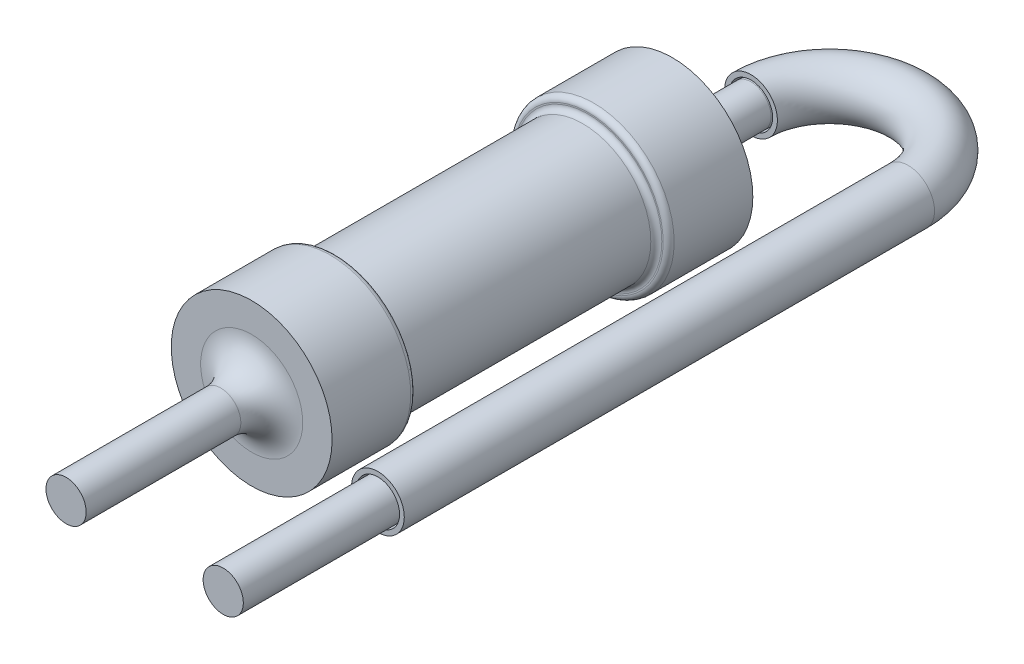
ISO-10303-21;
HEADER;
FILE_DESCRIPTION(('STEP AP214'),'2;1');
FILE_NAME('part.step','',(''),(''),'','','');
FILE_SCHEMA(('AUTOMOTIVE_DESIGN { 1 0 10303 214 1 1 1 1 }'));
ENDSEC;
DATA;
#1=APPLICATION_CONTEXT('core data for automotive mechanical design processes');
#2=APPLICATION_PROTOCOL_DEFINITION('international standard','automotive_design',2000,#1);
#3=PRODUCT_CONTEXT('',#1,'mechanical');
#4=PRODUCT('Part','Part','',(#3));
#5=PRODUCT_RELATED_PRODUCT_CATEGORY('part','',(#4));
#6=PRODUCT_DEFINITION_FORMATION('','',#4);
#7=PRODUCT_DEFINITION_CONTEXT('part definition',#1,'design');
#8=PRODUCT_DEFINITION('design','',#6,#7);
#9=PRODUCT_DEFINITION_SHAPE('','',#8);
#10=(LENGTH_UNIT() NAMED_UNIT(*) SI_UNIT(.MILLI.,.METRE.));
#11=(NAMED_UNIT(*) PLANE_ANGLE_UNIT() SI_UNIT($,.RADIAN.));
#12=(NAMED_UNIT(*) SI_UNIT($,.STERADIAN.) SOLID_ANGLE_UNIT());
#13=UNCERTAINTY_MEASURE_WITH_UNIT(LENGTH_MEASURE(1.E-05),#10,'distance_accuracy_value','');
#14=(GEOMETRIC_REPRESENTATION_CONTEXT(3) GLOBAL_UNCERTAINTY_ASSIGNED_CONTEXT((#13)) GLOBAL_UNIT_ASSIGNED_CONTEXT((#10,
#11,#12)) REPRESENTATION_CONTEXT('',''));
#15=CARTESIAN_POINT('',(0.,0.,0.));
#16=DIRECTION('',(0.,0.,1.));
#17=DIRECTION('',(1.,0.,0.));
#18=AXIS2_PLACEMENT_3D('',#15,#16,#17);
#19=CARTESIAN_POINT('',(1.27,0.,-4.67));
#20=DIRECTION('',(0.,-1.,0.));
#21=DIRECTION('',(0.,0.,-1.));
#22=AXIS2_PLACEMENT_3D('',#19,#20,#21);
#23=TOROIDAL_SURFACE('',#22,1.27,0.426600000000001);
#24=CARTESIAN_POINT('',(0.,0.,-4.67));
#25=DIRECTION('',(0.,0.,-1.));
#26=DIRECTION('',(-1.,0.,0.));
#27=AXIS2_PLACEMENT_3D('',#24,#25,#26);
#28=CIRCLE('',#27,0.426600000000001);
#29=CARTESIAN_POINT('',(-0.426600000000002,0.,-4.67));
#30=VERTEX_POINT('',#29);
#31=EDGE_CURVE('E70',#30,#30,#28,.T.);
#32=CARTESIAN_POINT('',(2.54,0.,-4.67));
#33=DIRECTION('',(0.,0.,1.));
#34=DIRECTION('',(1.,0.,0.));
#35=AXIS2_PLACEMENT_3D('',#32,#33,#34);
#36=CIRCLE('',#35,0.426600000000001);
#37=CARTESIAN_POINT('',(2.9666,0.,-4.67));
#38=VERTEX_POINT('',#37);
#39=EDGE_CURVE('E51',#38,#38,#36,.T.);
#40=CARTESIAN_POINT('',(1.27,0.,-4.67));
#41=DIRECTION('',(0.,-1.,0.));
#42=DIRECTION('',(0.,0.,-1.));
#43=AXIS2_PLACEMENT_3D('',#40,#41,#42);
#44=CIRCLE('',#43,1.6966);
#45=EDGE_CURVE('',#30,#38,#44,.T.);
#46=ORIENTED_EDGE('',*,*,#31,.T.);
#47=ORIENTED_EDGE('',*,*,#39,.F.);
#48=ORIENTED_EDGE('',*,*,#45,.T.);
#49=ORIENTED_EDGE('',*,*,#45,.F.);
#50=EDGE_LOOP('',(#46,#48,#47,#49));
#51=FACE_BOUND('',#50,.T.);
#52=ADVANCED_FACE('F47',(#51),#23,.T.);
#53=CARTESIAN_POINT('',(2.54,0.,-4.67));
#54=DIRECTION('',(0.,0.,1.));
#55=DIRECTION('',(1.,0.,0.));
#56=AXIS2_PLACEMENT_3D('',#53,#54,#55);
#57=CYLINDRICAL_SURFACE('',#56,0.426600000000001);
#58=CARTESIAN_POINT('',(2.54,0.,3.9));
#59=DIRECTION('',(0.,0.,1.));
#60=DIRECTION('',(1.,0.,0.));
#61=AXIS2_PLACEMENT_3D('',#58,#59,#60);
#62=CIRCLE('',#61,0.426600000000001);
#63=CARTESIAN_POINT('',(2.9666,0.,3.9));
#64=VERTEX_POINT('',#63);
#65=EDGE_CURVE('E67',#64,#64,#62,.T.);
#66=ORIENTED_EDGE('',*,*,#65,.F.);
#67=EDGE_LOOP('',(#66));
#68=FACE_BOUND('',#67,.T.);
#69=ORIENTED_EDGE('',*,*,#39,.T.);
#70=EDGE_LOOP('',(#69));
#71=FACE_BOUND('',#70,.T.);
#72=ADVANCED_FACE('F49',(#68,#71),#57,.T.);
#73=CARTESIAN_POINT('',(0.,0.,-4.67));
#74=DIRECTION('',(0.,0.,-1.));
#75=DIRECTION('',(-1.,0.,0.));
#76=AXIS2_PLACEMENT_3D('',#73,#74,#75);
#77=PLANE('',#76);
#78=CARTESIAN_POINT('',(0.,0.,-4.67));
#79=DIRECTION('',(0.,0.,-1.));
#80=DIRECTION('',(-1.,0.,0.));
#81=AXIS2_PLACEMENT_3D('',#78,#79,#80);
#82=CIRCLE('',#81,0.350400000000001);
#83=CARTESIAN_POINT('',(-0.350400000000002,0.,-4.67));
#84=VERTEX_POINT('',#83);
#85=EDGE_CURVE('E63',#84,#84,#82,.F.);
#86=ORIENTED_EDGE('',*,*,#85,.F.);
#87=EDGE_LOOP('',(#86));
#88=FACE_BOUND('',#87,.T.);
#89=ORIENTED_EDGE('',*,*,#31,.F.);
#90=EDGE_LOOP('',(#89));
#91=FACE_BOUND('',#90,.T.);
#92=ADVANCED_FACE('F84',(#88,#91),#77,.F.);
#93=CARTESIAN_POINT('',(2.54,0.,3.9));
#94=DIRECTION('',(0.,0.,1.));
#95=DIRECTION('',(1.,0.,0.));
#96=AXIS2_PLACEMENT_3D('',#93,#94,#95);
#97=PLANE('',#96);
#98=CARTESIAN_POINT('',(2.54,0.,3.9));
#99=DIRECTION('',(0.,0.,1.));
#100=DIRECTION('',(1.,0.,0.));
#101=AXIS2_PLACEMENT_3D('',#98,#99,#100);
#102=CIRCLE('',#101,0.350400000000001);
#103=CARTESIAN_POINT('',(2.8904,0.,3.9));
#104=VERTEX_POINT('',#103);
#105=EDGE_CURVE('E11',#104,#104,#102,.F.);
#106=ORIENTED_EDGE('',*,*,#105,.T.);
#107=EDGE_LOOP('',(#106));
#108=FACE_BOUND('',#107,.T.);
#109=ORIENTED_EDGE('',*,*,#65,.T.);
#110=EDGE_LOOP('',(#109));
#111=FACE_BOUND('',#110,.T.);
#112=ADVANCED_FACE('F95',(#108,#111),#97,.T.);
#113=CARTESIAN_POINT('',(1.27,0.,-4.67));
#114=DIRECTION('',(0.,-1.,0.));
#115=DIRECTION('',(0.,0.,-1.));
#116=AXIS2_PLACEMENT_3D('',#113,#114,#115);
#117=TOROIDAL_SURFACE('',#116,1.27,0.350400000000001);
#118=CARTESIAN_POINT('',(2.54,0.,-4.67));
#119=DIRECTION('',(0.,0.,1.));
#120=DIRECTION('',(1.,0.,0.));
#121=AXIS2_PLACEMENT_3D('',#118,#119,#120);
#122=CIRCLE('',#121,0.350400000000001);
#123=CARTESIAN_POINT('',(2.8904,0.,-4.67));
#124=VERTEX_POINT('',#123);
#125=EDGE_CURVE('E56',#124,#124,#122,.F.);
#126=CARTESIAN_POINT('',(1.27,0.,-4.67));
#127=DIRECTION('',(0.,-1.,0.));
#128=DIRECTION('',(0.,0.,-1.));
#129=AXIS2_PLACEMENT_3D('',#126,#127,#128);
#130=CIRCLE('',#129,1.6204);
#131=EDGE_CURVE('',#84,#124,#130,.T.);
#132=ORIENTED_EDGE('',*,*,#85,.T.);
#133=ORIENTED_EDGE('',*,*,#125,.F.);
#134=ORIENTED_EDGE('',*,*,#131,.T.);
#135=ORIENTED_EDGE('',*,*,#131,.F.);
#136=EDGE_LOOP('',(#132,#134,#133,#135));
#137=FACE_BOUND('',#136,.T.);
#138=ADVANCED_FACE('F89',(#137),#117,.F.);
#139=CARTESIAN_POINT('',(2.54,0.,-4.67));
#140=DIRECTION('',(0.,0.,1.));
#141=DIRECTION('',(1.,0.,0.));
#142=AXIS2_PLACEMENT_3D('',#139,#140,#141);
#143=CYLINDRICAL_SURFACE('',#142,0.350400000000001);
#144=ORIENTED_EDGE('',*,*,#105,.F.);
#145=EDGE_LOOP('',(#144));
#146=FACE_BOUND('',#145,.T.);
#147=ORIENTED_EDGE('',*,*,#125,.T.);
#148=EDGE_LOOP('',(#147));
#149=FACE_BOUND('',#148,.T.);
#150=ADVANCED_FACE('F87',(#146,#149),#143,.F.);
#151=CLOSED_SHELL('',(#52,#72,#92,#112,#138,#150));
#152=MANIFOLD_SOLID_BREP('B2',#151);
#153=CARTESIAN_POINT('',(0.,0.,-2.04));
#154=DIRECTION('',(0.,0.,-1.));
#155=DIRECTION('',(-1.,0.,0.));
#156=AXIS2_PLACEMENT_3D('',#153,#154,#155);
#157=CYLINDRICAL_SURFACE('',#156,1.3);
#158=CARTESIAN_POINT('',(0.,0.,-2.1289));
#159=DIRECTION('',(0.,0.,1.));
#160=DIRECTION('',(1.,0.,0.));
#161=AXIS2_PLACEMENT_3D('',#158,#159,#160);
#162=CIRCLE('',#161,1.3);
#163=CARTESIAN_POINT('',(1.3,0.,-2.1289));
#164=VERTEX_POINT('',#163);
#165=EDGE_CURVE('E188',#164,#164,#162,.F.);
#166=ORIENTED_EDGE('',*,*,#165,.T.);
#167=EDGE_LOOP('',(#166));
#168=FACE_BOUND('',#167,.T.);
#169=CARTESIAN_POINT('',(0.,0.,-3.4));
#170=DIRECTION('',(0.,0.,-1.));
#171=DIRECTION('',(1.,0.,0.));
#172=AXIS2_PLACEMENT_3D('',#169,#170,#171);
#173=CIRCLE('',#172,1.3);
#174=CARTESIAN_POINT('',(1.3,0.,-3.4));
#175=VERTEX_POINT('',#174);
#176=EDGE_CURVE('E207',#175,#175,#173,.T.);
#177=ORIENTED_EDGE('',*,*,#176,.F.);
#178=EDGE_LOOP('',(#177));
#179=FACE_BOUND('',#178,.T.);
#180=ADVANCED_FACE('F151',(#168,#179),#157,.T.);
#181=CARTESIAN_POINT('',(0.,0.,-2.04));
#182=DIRECTION('',(0.,0.,1.));
#183=DIRECTION('',(1.,0.,0.));
#184=AXIS2_PLACEMENT_3D('',#181,#182,#183);
#185=PLANE('',#184);
#186=CARTESIAN_POINT('',(0.,0.,-2.04));
#187=DIRECTION('',(0.,0.,1.));
#188=DIRECTION('',(1.,0.,0.));
#189=AXIS2_PLACEMENT_3D('',#186,#187,#188);
#190=CIRCLE('',#189,1.2111);
#191=CARTESIAN_POINT('',(1.2111,0.,-2.04));
#192=VERTEX_POINT('',#191);
#193=EDGE_CURVE('E180',#192,#192,#190,.T.);
#194=ORIENTED_EDGE('',*,*,#193,.T.);
#195=EDGE_LOOP('',(#194));
#196=FACE_BOUND('',#195,.T.);
#197=CARTESIAN_POINT('',(0.,0.,-2.04));
#198=DIRECTION('',(0.,0.,1.));
#199=DIRECTION('',(1.,0.,0.));
#200=AXIS2_PLACEMENT_3D('',#197,#198,#199);
#201=CIRCLE('',#200,1.1889);
#202=CARTESIAN_POINT('',(1.1889,0.,-2.04));
#203=VERTEX_POINT('',#202);
#204=EDGE_CURVE('E184',#203,#203,#201,.F.);
#205=ORIENTED_EDGE('',*,*,#204,.T.);
#206=EDGE_LOOP('',(#205));
#207=FACE_BOUND('',#206,.T.);
#208=ADVANCED_FACE('F257',(#196,#207),#185,.T.);
#209=CARTESIAN_POINT('',(0.,0.,-3.4));
#210=DIRECTION('',(0.,0.,1.));
#211=DIRECTION('',(1.,0.,0.));
#212=AXIS2_PLACEMENT_3D('',#209,#210,#211);
#213=PLANE('',#212);
#214=CARTESIAN_POINT('',(0.,0.,-3.4));
#215=DIRECTION('',(0.,0.,1.));
#216=DIRECTION('',(1.,0.,0.));
#217=AXIS2_PLACEMENT_3D('',#214,#215,#216);
#218=CIRCLE('',#217,0.825);
#219=CARTESIAN_POINT('',(0.825,0.,-3.4));
#220=VERTEX_POINT('',#219);
#221=EDGE_CURVE('E192',#220,#220,#218,.T.);
#222=ORIENTED_EDGE('',*,*,#221,.T.);
#223=EDGE_LOOP('',(#222));
#224=FACE_BOUND('',#223,.T.);
#225=ORIENTED_EDGE('',*,*,#176,.T.);
#226=EDGE_LOOP('',(#225));
#227=FACE_BOUND('',#226,.T.);
#228=ADVANCED_FACE('F263',(#224,#227),#213,.F.);
#229=CARTESIAN_POINT('',(0.,0.,2.04000000000001));
#230=DIRECTION('',(0.,0.,-1.));
#231=DIRECTION('',(-1.,0.,0.));
#232=AXIS2_PLACEMENT_3D('',#229,#230,#231);
#233=CYLINDRICAL_SURFACE('',#232,1.1);
#234=CARTESIAN_POINT('',(0.,0.,-1.9511));
#235=DIRECTION('',(0.,0.,1.));
#236=DIRECTION('',(1.,0.,0.));
#237=AXIS2_PLACEMENT_3D('',#234,#235,#236);
#238=CIRCLE('',#237,1.1);
#239=CARTESIAN_POINT('',(1.1,0.,-1.9511));
#240=VERTEX_POINT('',#239);
#241=EDGE_CURVE('E173',#240,#240,#238,.T.);
#242=ORIENTED_EDGE('',*,*,#241,.T.);
#243=EDGE_LOOP('',(#242));
#244=FACE_BOUND('',#243,.T.);
#245=CARTESIAN_POINT('',(0.,0.,1.95110000000001));
#246=DIRECTION('',(0.,0.,1.));
#247=DIRECTION('',(1.,0.,0.));
#248=AXIS2_PLACEMENT_3D('',#245,#246,#247);
#249=CIRCLE('',#248,1.1);
#250=CARTESIAN_POINT('',(1.1,0.,1.95110000000001));
#251=VERTEX_POINT('',#250);
#252=EDGE_CURVE('E177',#251,#251,#249,.F.);
#253=ORIENTED_EDGE('',*,*,#252,.T.);
#254=EDGE_LOOP('',(#253));
#255=FACE_BOUND('',#254,.T.);
#256=ADVANCED_FACE('F412',(#244,#255),#233,.T.);
#257=CARTESIAN_POINT('',(0.,0.,3.4));
#258=DIRECTION('',(0.,0.,-1.));
#259=DIRECTION('',(-1.,0.,0.));
#260=AXIS2_PLACEMENT_3D('',#257,#258,#259);
#261=CYLINDRICAL_SURFACE('',#260,1.3);
#262=CARTESIAN_POINT('',(0.,0.,2.12890000000001));
#263=DIRECTION('',(0.,0.,1.));
#264=DIRECTION('',(1.,0.,0.));
#265=AXIS2_PLACEMENT_3D('',#262,#263,#264);
#266=CIRCLE('',#265,1.3);
#267=CARTESIAN_POINT('',(1.3,0.,2.12890000000001));
#268=VERTEX_POINT('',#267);
#269=EDGE_CURVE('E46',#268,#268,#266,.T.);
#270=ORIENTED_EDGE('',*,*,#269,.T.);
#271=EDGE_LOOP('',(#270));
#272=FACE_BOUND('',#271,.T.);
#273=CARTESIAN_POINT('',(0.,0.,3.4));
#274=DIRECTION('',(0.,0.,-1.));
#275=DIRECTION('',(1.,0.,0.));
#276=AXIS2_PLACEMENT_3D('',#273,#274,#275);
#277=CIRCLE('',#276,1.3);
#278=CARTESIAN_POINT('',(1.3,0.,3.4));
#279=VERTEX_POINT('',#278);
#280=EDGE_CURVE('E211',#279,#279,#277,.T.);
#281=ORIENTED_EDGE('',*,*,#280,.T.);
#282=EDGE_LOOP('',(#281));
#283=FACE_BOUND('',#282,.T.);
#284=ADVANCED_FACE('F404',(#272,#283),#261,.T.);
#285=CARTESIAN_POINT('',(0.,0.,3.4));
#286=DIRECTION('',(0.,0.,1.));
#287=DIRECTION('',(1.,0.,0.));
#288=AXIS2_PLACEMENT_3D('',#285,#286,#287);
#289=PLANE('',#288);
#290=CARTESIAN_POINT('',(0.,0.,3.4));
#291=DIRECTION('',(0.,0.,1.));
#292=DIRECTION('',(1.,0.,0.));
#293=AXIS2_PLACEMENT_3D('',#290,#291,#292);
#294=CIRCLE('',#293,0.825);
#295=CARTESIAN_POINT('',(0.825,0.,3.4));
#296=VERTEX_POINT('',#295);
#297=EDGE_CURVE('E199',#296,#296,#294,.F.);
#298=ORIENTED_EDGE('',*,*,#297,.T.);
#299=EDGE_LOOP('',(#298));
#300=FACE_BOUND('',#299,.T.);
#301=ORIENTED_EDGE('',*,*,#280,.F.);
#302=EDGE_LOOP('',(#301));
#303=FACE_BOUND('',#302,.T.);
#304=ADVANCED_FACE('F252',(#300,#303),#289,.T.);
#305=CARTESIAN_POINT('',(0.,0.,2.04000000000001));
#306=DIRECTION('',(0.,0.,1.));
#307=DIRECTION('',(1.,0.,0.));
#308=AXIS2_PLACEMENT_3D('',#305,#306,#307);
#309=PLANE('',#308);
#310=CARTESIAN_POINT('',(0.,0.,2.04000000000001));
#311=DIRECTION('',(0.,0.,1.));
#312=DIRECTION('',(1.,0.,0.));
#313=AXIS2_PLACEMENT_3D('',#310,#311,#312);
#314=CIRCLE('',#313,1.2111);
#315=CARTESIAN_POINT('',(1.2111,0.,2.04000000000001));
#316=VERTEX_POINT('',#315);
#317=EDGE_CURVE('E160',#316,#316,#314,.F.);
#318=ORIENTED_EDGE('',*,*,#317,.T.);
#319=EDGE_LOOP('',(#318));
#320=FACE_BOUND('',#319,.T.);
#321=CARTESIAN_POINT('',(0.,0.,2.04000000000001));
#322=DIRECTION('',(0.,0.,1.));
#323=DIRECTION('',(1.,0.,0.));
#324=AXIS2_PLACEMENT_3D('',#321,#322,#323);
#325=CIRCLE('',#324,1.1889);
#326=CARTESIAN_POINT('',(1.1889,0.,2.04000000000001));
#327=VERTEX_POINT('',#326);
#328=EDGE_CURVE('E167',#327,#327,#325,.T.);
#329=ORIENTED_EDGE('',*,*,#328,.T.);
#330=EDGE_LOOP('',(#329));
#331=FACE_BOUND('',#330,.T.);
#332=ADVANCED_FACE('F242',(#320,#331),#309,.F.);
#333=CARTESIAN_POINT('',(0.,0.,-4.67));
#334=DIRECTION('',(0.,0.,1.));
#335=DIRECTION('',(1.,0.,0.));
#336=AXIS2_PLACEMENT_3D('',#333,#334,#335);
#337=CYLINDRICAL_SURFACE('',#336,0.325);
#338=CARTESIAN_POINT('',(0.,0.,-3.9));
#339=DIRECTION('',(0.,0.,1.));
#340=DIRECTION('',(1.,0.,0.));
#341=AXIS2_PLACEMENT_3D('',#338,#339,#340);
#342=CIRCLE('',#341,0.325);
#343=CARTESIAN_POINT('',(0.325,0.,-3.9));
#344=VERTEX_POINT('',#343);
#345=EDGE_CURVE('E195',#344,#344,#342,.F.);
#346=ORIENTED_EDGE('',*,*,#345,.T.);
#347=EDGE_LOOP('',(#346));
#348=FACE_BOUND('',#347,.T.);
#349=CARTESIAN_POINT('',(0.,0.,-4.67));
#350=DIRECTION('',(0.,0.,-1.));
#351=DIRECTION('',(-1.,0.,0.));
#352=AXIS2_PLACEMENT_3D('',#349,#350,#351);
#353=CIRCLE('',#352,0.325);
#354=CARTESIAN_POINT('',(-0.325,0.,-4.67));
#355=VERTEX_POINT('',#354);
#356=EDGE_CURVE('E155',#355,#355,#353,.T.);
#357=ORIENTED_EDGE('',*,*,#356,.F.);
#358=EDGE_LOOP('',(#357));
#359=FACE_BOUND('',#358,.T.);
#360=ADVANCED_FACE('F239',(#348,#359),#337,.T.);
#361=CARTESIAN_POINT('',(0.,0.,6.4));
#362=DIRECTION('',(0.,0.,-1.));
#363=DIRECTION('',(-1.,0.,0.));
#364=AXIS2_PLACEMENT_3D('',#361,#362,#363);
#365=CYLINDRICAL_SURFACE('',#364,0.325);
#366=CARTESIAN_POINT('',(0.,0.,3.9));
#367=DIRECTION('',(0.,0.,1.));
#368=DIRECTION('',(1.,0.,0.));
#369=AXIS2_PLACEMENT_3D('',#366,#367,#368);
#370=CIRCLE('',#369,0.325);
#371=CARTESIAN_POINT('',(0.325,0.,3.9));
#372=VERTEX_POINT('',#371);
#373=EDGE_CURVE('E203',#372,#372,#370,.T.);
#374=ORIENTED_EDGE('',*,*,#373,.T.);
#375=EDGE_LOOP('',(#374));
#376=FACE_BOUND('',#375,.T.);
#377=CARTESIAN_POINT('',(0.,0.,6.4));
#378=DIRECTION('',(0.,0.,1.));
#379=DIRECTION('',(1.,0.,0.));
#380=AXIS2_PLACEMENT_3D('',#377,#378,#379);
#381=CIRCLE('',#380,0.325);
#382=CARTESIAN_POINT('',(0.325,0.,6.4));
#383=VERTEX_POINT('',#382);
#384=EDGE_CURVE('E215',#383,#383,#381,.T.);
#385=ORIENTED_EDGE('',*,*,#384,.F.);
#386=EDGE_LOOP('',(#385));
#387=FACE_BOUND('',#386,.T.);
#388=ADVANCED_FACE('F241',(#376,#387),#365,.T.);
#389=CARTESIAN_POINT('',(0.,0.,6.4));
#390=DIRECTION('',(0.,0.,1.));
#391=DIRECTION('',(1.,0.,0.));
#392=AXIS2_PLACEMENT_3D('',#389,#390,#391);
#393=PLANE('',#392);
#394=ORIENTED_EDGE('',*,*,#384,.T.);
#395=EDGE_LOOP('',(#394));
#396=FACE_BOUND('',#395,.T.);
#397=ADVANCED_FACE('F249',(#396),#393,.T.);
#398=CARTESIAN_POINT('',(0.,0.,3.9));
#399=DIRECTION('',(0.,0.,1.));
#400=DIRECTION('',(1.,0.,0.));
#401=AXIS2_PLACEMENT_3D('',#398,#399,#400);
#402=TOROIDAL_SURFACE('',#401,0.825,0.5);
#403=ORIENTED_EDGE('',*,*,#297,.F.);
#404=EDGE_LOOP('',(#403));
#405=FACE_BOUND('',#404,.T.);
#406=ORIENTED_EDGE('',*,*,#373,.F.);
#407=EDGE_LOOP('',(#406));
#408=FACE_BOUND('',#407,.T.);
#409=ADVANCED_FACE('F269',(#405,#408),#402,.F.);
#410=CARTESIAN_POINT('',(0.,0.,-3.9));
#411=DIRECTION('',(0.,0.,1.));
#412=DIRECTION('',(1.,0.,0.));
#413=AXIS2_PLACEMENT_3D('',#410,#411,#412);
#414=TOROIDAL_SURFACE('',#413,0.825,0.5);
#415=ORIENTED_EDGE('',*,*,#221,.F.);
#416=EDGE_LOOP('',(#415));
#417=FACE_BOUND('',#416,.T.);
#418=ORIENTED_EDGE('',*,*,#345,.F.);
#419=EDGE_LOOP('',(#418));
#420=FACE_BOUND('',#419,.T.);
#421=ADVANCED_FACE('F272',(#417,#420),#414,.F.);
#422=CARTESIAN_POINT('',(0.,0.,-2.1289));
#423=DIRECTION('',(0.,0.,1.));
#424=DIRECTION('',(1.,0.,0.));
#425=AXIS2_PLACEMENT_3D('',#422,#423,#424);
#426=TOROIDAL_SURFACE('',#425,1.2111,0.0889);
#427=ORIENTED_EDGE('',*,*,#193,.F.);
#428=EDGE_LOOP('',(#427));
#429=FACE_BOUND('',#428,.T.);
#430=ORIENTED_EDGE('',*,*,#165,.F.);
#431=EDGE_LOOP('',(#430));
#432=FACE_BOUND('',#431,.T.);
#433=ADVANCED_FACE('F276',(#429,#432),#426,.T.);
#434=CARTESIAN_POINT('',(0.,0.,-1.9511));
#435=DIRECTION('',(0.,0.,1.));
#436=DIRECTION('',(1.,0.,0.));
#437=AXIS2_PLACEMENT_3D('',#434,#435,#436);
#438=TOROIDAL_SURFACE('',#437,1.1889,0.0889);
#439=ORIENTED_EDGE('',*,*,#204,.F.);
#440=EDGE_LOOP('',(#439));
#441=FACE_BOUND('',#440,.T.);
#442=ORIENTED_EDGE('',*,*,#241,.F.);
#443=EDGE_LOOP('',(#442));
#444=FACE_BOUND('',#443,.T.);
#445=ADVANCED_FACE('F280',(#441,#444),#438,.F.);
#446=CARTESIAN_POINT('',(0.,0.,2.12890000000001));
#447=DIRECTION('',(0.,0.,1.));
#448=DIRECTION('',(1.,0.,0.));
#449=AXIS2_PLACEMENT_3D('',#446,#447,#448);
#450=TOROIDAL_SURFACE('',#449,1.2111,0.0889);
#451=ORIENTED_EDGE('',*,*,#269,.F.);
#452=EDGE_LOOP('',(#451));
#453=FACE_BOUND('',#452,.T.);
#454=ORIENTED_EDGE('',*,*,#317,.F.);
#455=EDGE_LOOP('',(#454));
#456=FACE_BOUND('',#455,.T.);
#457=ADVANCED_FACE('F283',(#453,#456),#450,.T.);
#458=CARTESIAN_POINT('',(0.,0.,1.95110000000001));
#459=DIRECTION('',(0.,0.,1.));
#460=DIRECTION('',(1.,0.,0.));
#461=AXIS2_PLACEMENT_3D('',#458,#459,#460);
#462=TOROIDAL_SURFACE('',#461,1.1889,0.0889);
#463=ORIENTED_EDGE('',*,*,#252,.F.);
#464=EDGE_LOOP('',(#463));
#465=FACE_BOUND('',#464,.T.);
#466=ORIENTED_EDGE('',*,*,#328,.F.);
#467=EDGE_LOOP('',(#466));
#468=FACE_BOUND('',#467,.T.);
#469=ADVANCED_FACE('F153',(#465,#468),#462,.F.);
#470=CARTESIAN_POINT('',(2.54,0.,6.4));
#471=DIRECTION('',(0.,0.,1.));
#472=DIRECTION('',(1.,0.,0.));
#473=AXIS2_PLACEMENT_3D('',#470,#471,#472);
#474=PLANE('',#473);
#475=CARTESIAN_POINT('',(2.54,0.,6.4));
#476=DIRECTION('',(0.,0.,1.));
#477=DIRECTION('',(1.,0.,0.));
#478=AXIS2_PLACEMENT_3D('',#475,#476,#477);
#479=CIRCLE('',#478,0.325);
#480=CARTESIAN_POINT('',(2.865,0.,6.4));
#481=VERTEX_POINT('',#480);
#482=EDGE_CURVE('E219',#481,#481,#479,.T.);
#483=ORIENTED_EDGE('',*,*,#482,.T.);
#484=EDGE_LOOP('',(#483));
#485=FACE_BOUND('',#484,.T.);
#486=ADVANCED_FACE('F234',(#485),#474,.T.);
#487=CARTESIAN_POINT('',(1.27,0.,-4.67));
#488=DIRECTION('',(0.,-1.,0.));
#489=DIRECTION('',(0.,0.,-1.));
#490=AXIS2_PLACEMENT_3D('',#487,#488,#489);
#491=TOROIDAL_SURFACE('',#490,1.27,0.325);
#492=CARTESIAN_POINT('',(2.53999999999999,0.,-4.67));
#493=DIRECTION('',(0.,0.,1.));
#494=DIRECTION('',(1.,0.,0.));
#495=AXIS2_PLACEMENT_3D('',#492,#493,#494);
#496=CIRCLE('',#495,0.325);
#497=CARTESIAN_POINT('',(2.86499999999999,0.,-4.67));
#498=VERTEX_POINT('',#497);
#499=EDGE_CURVE('E223',#498,#498,#496,.T.);
#500=CARTESIAN_POINT('',(1.27,0.,-4.67));
#501=DIRECTION('',(0.,-1.,0.));
#502=DIRECTION('',(0.,0.,-1.));
#503=AXIS2_PLACEMENT_3D('',#500,#501,#502);
#504=CIRCLE('',#503,1.595);
#505=EDGE_CURVE('',#355,#498,#504,.T.);
#506=ORIENTED_EDGE('',*,*,#356,.T.);
#507=ORIENTED_EDGE('',*,*,#499,.F.);
#508=ORIENTED_EDGE('',*,*,#505,.T.);
#509=ORIENTED_EDGE('',*,*,#505,.F.);
#510=EDGE_LOOP('',(#506,#508,#507,#509));
#511=FACE_BOUND('',#510,.T.);
#512=ADVANCED_FACE('F231',(#511),#491,.T.);
#513=CARTESIAN_POINT('',(2.54,0.,-4.67));
#514=DIRECTION('',(0.,0.,1.));
#515=DIRECTION('',(1.,0.,0.));
#516=AXIS2_PLACEMENT_3D('',#513,#514,#515);
#517=CYLINDRICAL_SURFACE('',#516,0.325);
#518=ORIENTED_EDGE('',*,*,#482,.F.);
#519=EDGE_LOOP('',(#518));
#520=FACE_BOUND('',#519,.T.);
#521=ORIENTED_EDGE('',*,*,#499,.T.);
#522=EDGE_LOOP('',(#521));
#523=FACE_BOUND('',#522,.T.);
#524=ADVANCED_FACE('F229',(#520,#523),#517,.T.);
#525=CLOSED_SHELL('',(#180,#208,#228,#256,#284,#304,#332,#360,#388,#397,#409,#421,#433,#445,
#457,#469,#486,#512,#524));
#526=MANIFOLD_SOLID_BREP('B6',#525);
#527=ADVANCED_BREP_SHAPE_REPRESENTATION('',(#18,#152,#526),#14);
#528=SHAPE_DEFINITION_REPRESENTATION(#9,#527);
ENDSEC;
END-ISO-10303-21;
